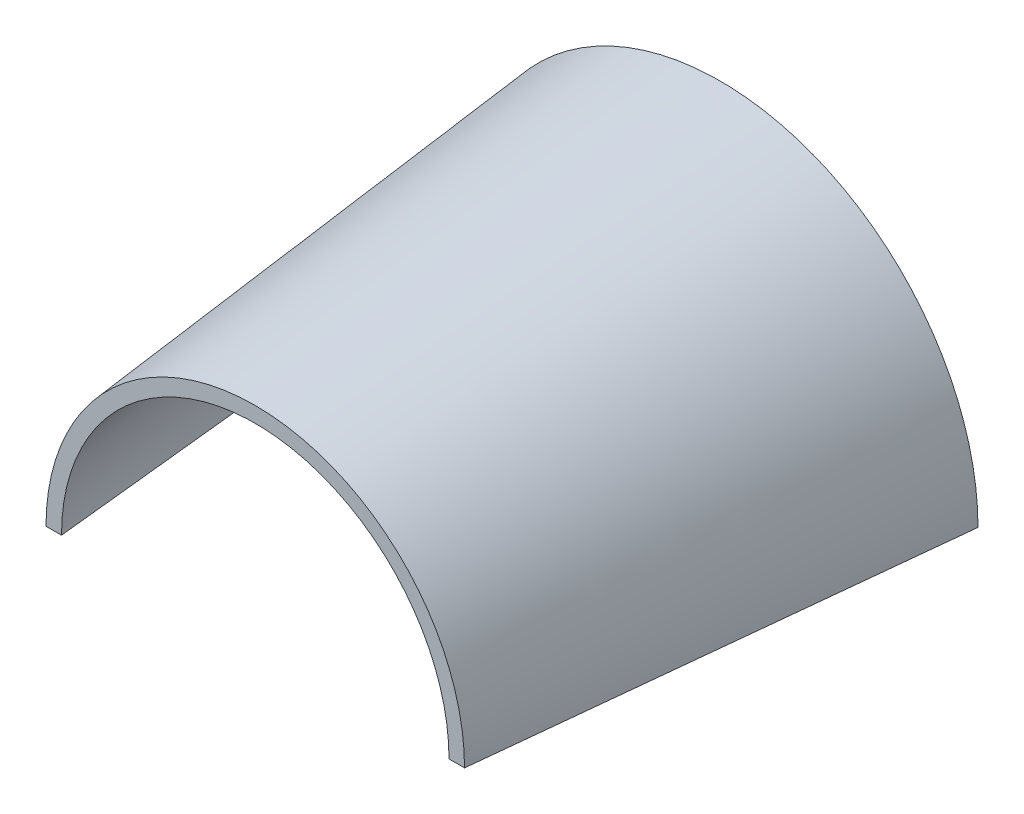
ISO-10303-21;
HEADER;
FILE_DESCRIPTION(('STEP AP214'),'2;1');
FILE_NAME('part.step','',(''),(''),'','','');
FILE_SCHEMA(('AUTOMOTIVE_DESIGN { 1 0 10303 214 1 1 1 1 }'));
ENDSEC;
DATA;
#1=APPLICATION_CONTEXT('core data for automotive mechanical design processes');
#2=APPLICATION_PROTOCOL_DEFINITION('international standard','automotive_design',2000,#1);
#3=PRODUCT_CONTEXT('',#1,'mechanical');
#4=PRODUCT('Part','Part','',(#3));
#5=PRODUCT_RELATED_PRODUCT_CATEGORY('part','',(#4));
#6=PRODUCT_DEFINITION_FORMATION('','',#4);
#7=PRODUCT_DEFINITION_CONTEXT('part definition',#1,'design');
#8=PRODUCT_DEFINITION('design','',#6,#7);
#9=PRODUCT_DEFINITION_SHAPE('','',#8);
#10=(LENGTH_UNIT() NAMED_UNIT(*) SI_UNIT(.MILLI.,.METRE.));
#11=(NAMED_UNIT(*) PLANE_ANGLE_UNIT() SI_UNIT($,.RADIAN.));
#12=(NAMED_UNIT(*) SI_UNIT($,.STERADIAN.) SOLID_ANGLE_UNIT());
#13=UNCERTAINTY_MEASURE_WITH_UNIT(LENGTH_MEASURE(1.E-05),#10,'distance_accuracy_value','');
#14=(GEOMETRIC_REPRESENTATION_CONTEXT(3) GLOBAL_UNCERTAINTY_ASSIGNED_CONTEXT((#13)) GLOBAL_UNIT_ASSIGNED_CONTEXT((#10,
#11,#12)) REPRESENTATION_CONTEXT('',''));
#15=CARTESIAN_POINT('',(0.,0.,0.));
#16=DIRECTION('',(0.,0.,1.));
#17=DIRECTION('',(1.,0.,0.));
#18=AXIS2_PLACEMENT_3D('',#15,#16,#17);
#19=CARTESIAN_POINT('',(0.,0.,120.));
#20=DIRECTION('',(0.,0.,1.));
#21=DIRECTION('',(1.,0.,0.));
#22=AXIS2_PLACEMENT_3D('',#19,#20,#21);
#23=PLANE('',#22);
#24=DIRECTION('',(1.,0.,0.));
#25=VECTOR('',#24,1.);
#26=CARTESIAN_POINT('',(0.,0.,120.));
#27=LINE('',#26,#25);
#28=CARTESIAN_POINT('',(50.,0.,120.));
#29=VERTEX_POINT('',#28);
#30=CARTESIAN_POINT('',(54.,0.,120.));
#31=VERTEX_POINT('',#30);
#32=EDGE_CURVE('E174',#29,#31,#27,.T.);
#33=ORIENTED_EDGE('',*,*,#32,.T.);
#34=CARTESIAN_POINT('',(0.,0.,120.));
#35=DIRECTION('',(0.,0.,1.));
#36=DIRECTION('',(1.,0.,0.));
#37=AXIS2_PLACEMENT_3D('',#34,#35,#36);
#38=CIRCLE('',#37,54.);
#39=CARTESIAN_POINT('',(-54.,0.,120.));
#40=VERTEX_POINT('',#39);
#41=EDGE_CURVE('E170',#31,#40,#38,.T.);
#42=ORIENTED_EDGE('',*,*,#41,.T.);
#43=DIRECTION('',(1.,0.,0.));
#44=VECTOR('',#43,1.);
#45=CARTESIAN_POINT('',(0.,0.,120.));
#46=LINE('',#45,#44);
#47=CARTESIAN_POINT('',(-50.,0.,120.));
#48=VERTEX_POINT('',#47);
#49=EDGE_CURVE('E106',#40,#48,#46,.T.);
#50=ORIENTED_EDGE('',*,*,#49,.T.);
#51=CARTESIAN_POINT('',(0.,0.,120.));
#52=DIRECTION('',(0.,0.,1.));
#53=DIRECTION('',(1.,0.,0.));
#54=AXIS2_PLACEMENT_3D('',#51,#52,#53);
#55=CIRCLE('',#54,50.);
#56=EDGE_CURVE('E13',#29,#48,#55,.T.);
#57=ORIENTED_EDGE('',*,*,#56,.F.);
#58=EDGE_LOOP('',(#33,#42,#50,#57));
#59=FACE_BOUND('',#58,.T.);
#60=ADVANCED_FACE('F95',(#59),#23,.T.);
#61=CARTESIAN_POINT('',(0.,0.,0.));
#62=DIRECTION('',(0.,0.,1.));
#63=DIRECTION('',(1.,0.,0.));
#64=AXIS2_PLACEMENT_3D('',#61,#62,#63);
#65=PLANE('',#64);
#66=DIRECTION('',(1.,0.,0.));
#67=VECTOR('',#66,1.);
#68=CARTESIAN_POINT('',(0.,0.,0.));
#69=LINE('',#68,#67);
#70=CARTESIAN_POINT('',(62.5,0.,0.));
#71=VERTEX_POINT('',#70);
#72=CARTESIAN_POINT('',(66.5,0.,0.));
#73=VERTEX_POINT('',#72);
#74=EDGE_CURVE('E145',#71,#73,#69,.T.);
#75=ORIENTED_EDGE('',*,*,#74,.F.);
#76=CARTESIAN_POINT('',(0.,0.,0.));
#77=DIRECTION('',(0.,0.,1.));
#78=DIRECTION('',(1.,0.,0.));
#79=AXIS2_PLACEMENT_3D('',#76,#77,#78);
#80=CIRCLE('',#79,62.5);
#81=CARTESIAN_POINT('',(-62.5,0.,0.));
#82=VERTEX_POINT('',#81);
#83=EDGE_CURVE('E229',#71,#82,#80,.T.);
#84=ORIENTED_EDGE('',*,*,#83,.T.);
#85=DIRECTION('',(-1.,0.,0.));
#86=VECTOR('',#85,1.);
#87=CARTESIAN_POINT('',(0.,0.,0.));
#88=LINE('',#87,#86);
#89=CARTESIAN_POINT('',(-66.5,0.,0.));
#90=VERTEX_POINT('',#89);
#91=EDGE_CURVE('E147',#82,#90,#88,.T.);
#92=ORIENTED_EDGE('',*,*,#91,.T.);
#93=CARTESIAN_POINT('',(0.,0.,0.));
#94=DIRECTION('',(0.,0.,1.));
#95=DIRECTION('',(1.,0.,0.));
#96=AXIS2_PLACEMENT_3D('',#93,#94,#95);
#97=CIRCLE('',#96,66.5);
#98=EDGE_CURVE('E141',#73,#90,#97,.T.);
#99=ORIENTED_EDGE('',*,*,#98,.F.);
#100=EDGE_LOOP('',(#75,#84,#92,#99));
#101=FACE_BOUND('',#100,.T.);
#102=ADVANCED_FACE('F144',(#101),#65,.F.);
#103=CARTESIAN_POINT('',(66.5,0.,0.));
#104=CARTESIAN_POINT('',(62.3333333333333,0.,40.));
#105=CARTESIAN_POINT('',(58.1666666666667,0.,80.));
#106=CARTESIAN_POINT('',(54.,0.,120.));
#107=CARTESIAN_POINT('',(66.5,4.35241478742894,0.));
#108=CARTESIAN_POINT('',(62.3333333333333,4.07970709398101,40.));
#109=CARTESIAN_POINT('',(58.1666666666667,3.80699940053308,80.));
#110=CARTESIAN_POINT('',(54.,3.53429170708515,120.));
#111=CARTESIAN_POINT('',(65.6428999755586,13.0571764997225,0.));
#112=CARTESIAN_POINT('',(61.5299382362228,12.2390504305927,39.9999999999999));
#113=CARTESIAN_POINT('',(57.416976496887,11.4209243614629,79.9999999999997));
#114=CARTESIAN_POINT('',(53.3040147575512,10.6027982923331,120.));
#115=CARTESIAN_POINT('',(61.8341063541393,25.6125517905188,0.));
#116=CARTESIAN_POINT('',(57.9597803577342,24.0077628618881,40.0000000000001));
#117=CARTESIAN_POINT('',(54.0854543613292,22.4029739332574,80.0000000000003));
#118=CARTESIAN_POINT('',(50.2111283649241,20.7981850046267,120.));
#119=CARTESIAN_POINT('',(55.6493033731848,37.1836475654939,0.));
#120=CARTESIAN_POINT('',(52.1625058175017,34.8538486187443,39.9999999999999));
#121=CARTESIAN_POINT('',(48.6757082618187,32.5240496719946,79.9999999999998));
#122=CARTESIAN_POINT('',(45.1889107061356,30.194250725245,120.));
#123=CARTESIAN_POINT('',(47.3258098495198,47.3258086871024,0.));
#124=CARTESIAN_POINT('',(44.3605285945918,44.3605354616453,40.0000000000001));
#125=CARTESIAN_POINT('',(41.3952473396639,41.3952622361883,80.0000000000002));
#126=CARTESIAN_POINT('',(38.4299660847359,38.4299890107312,120.));
#127=CARTESIAN_POINT('',(37.1836742405193,55.6492650380103,0.));
#128=CARTESIAN_POINT('',(34.8538687124275,52.1624704597443,39.9999999999999));
#129=CARTESIAN_POINT('',(32.5240631843357,48.6756758814783,79.9999999999999));
#130=CARTESIAN_POINT('',(30.1942576562438,45.1888813032123,120.));
#131=CARTESIAN_POINT('',(25.6125531444804,61.8341553424915,0.));
#132=CARTESIAN_POINT('',(24.0077541334971,57.959835604822,40.));
#133=CARTESIAN_POINT('',(22.4029551225138,54.0855158671526,80.0000000000001));
#134=CARTESIAN_POINT('',(20.7981561115305,50.2111961294832,120.));
#135=CARTESIAN_POINT('',(13.0571710714316,65.6427919652264,0.));
#136=CARTESIAN_POINT('',(12.2390518423359,61.5298351593443,40.));
#137=CARTESIAN_POINT('',(11.4209326132402,57.4168783534622,80.));
#138=CARTESIAN_POINT('',(10.6028133841444,53.30392154758,120.));
#139=CARTESIAN_POINT('',(0.,66.9288119051122,0.));
#140=CARTESIAN_POINT('',(0.,62.735277297787,39.9999999999999));
#141=CARTESIAN_POINT('',(0.,58.5417426904618,79.9999999999998));
#142=CARTESIAN_POINT('',(0.,54.3482080831366,120.));
#143=CARTESIAN_POINT('',(-13.0571710714316,65.6427919652264,0.));
#144=CARTESIAN_POINT('',(-12.2390518423359,61.5298351593443,40.0000000000001));
#145=CARTESIAN_POINT('',(-11.4209326132402,57.4168783534622,80.0000000000001));
#146=CARTESIAN_POINT('',(-10.6028133841445,53.3039215475801,120.));
#147=CARTESIAN_POINT('',(-25.6125531444805,61.8341553424915,0.));
#148=CARTESIAN_POINT('',(-24.0077541334972,57.959835604822,40.));
#149=CARTESIAN_POINT('',(-22.4029551225139,54.0855158671525,79.9999999999999));
#150=CARTESIAN_POINT('',(-20.7981561115307,50.211196129483,120.));
#151=CARTESIAN_POINT('',(-37.1836742405193,55.6492650380102,0.));
#152=CARTESIAN_POINT('',(-34.8538687124274,52.1624704597443,40.0000000000001));
#153=CARTESIAN_POINT('',(-32.5240631843356,48.6756758814783,80.0000000000002));
#154=CARTESIAN_POINT('',(-30.1942576562438,45.1888813032123,120.));
#155=CARTESIAN_POINT('',(-47.32580984952,47.3258086871023,0.));
#156=CARTESIAN_POINT('',(-44.360528594592,44.3605354616453,39.9999999999999));
#157=CARTESIAN_POINT('',(-41.395247339664,41.3952622361882,79.9999999999998));
#158=CARTESIAN_POINT('',(-38.4299660847361,38.4299890107311,120.));
#159=CARTESIAN_POINT('',(-55.6493033731847,37.183647565494,0.));
#160=CARTESIAN_POINT('',(-52.1625058175017,34.8538486187443,40.));
#161=CARTESIAN_POINT('',(-48.6757082618186,32.5240496719946,80.));
#162=CARTESIAN_POINT('',(-45.1889107061356,30.1942507252449,120.));
#163=CARTESIAN_POINT('',(-61.8341063541395,25.6125517905187,0.));
#164=CARTESIAN_POINT('',(-57.9597803577344,24.007762861888,40.0000000000001));
#165=CARTESIAN_POINT('',(-54.0854543613293,22.4029739332573,80.0000000000002));
#166=CARTESIAN_POINT('',(-50.2111283649242,20.7981850046266,120.));
#167=CARTESIAN_POINT('',(-65.6428999755585,13.0571764997225,0.));
#168=CARTESIAN_POINT('',(-61.5299382362228,12.2390504305927,39.9999999999999));
#169=CARTESIAN_POINT('',(-57.416976496887,11.4209243614629,79.9999999999998));
#170=CARTESIAN_POINT('',(-53.3040147575512,10.6027982923331,120.));
#171=CARTESIAN_POINT('',(-66.5,4.35241478742895,0.));
#172=CARTESIAN_POINT('',(-62.3333333333333,4.07970709398102,40.));
#173=CARTESIAN_POINT('',(-58.1666666666667,3.80699940053309,80.));
#174=CARTESIAN_POINT('',(-54.,3.53429170708516,120.));
#175=CARTESIAN_POINT('',(-66.5,0.,0.));
#176=CARTESIAN_POINT('',(-62.3333333333333,0.,40.));
#177=CARTESIAN_POINT('',(-58.1666666666667,0.,80.));
#178=CARTESIAN_POINT('',(-54.,0.,120.));
#179=B_SPLINE_SURFACE_WITH_KNOTS('',3,3,((#103,#104,#105,#106),(#107,#108,#109,#110),(#111,#112,
#113,#114),(#115,#116,#117,#118),(#119,#120,#121,#122),(#123,#124,#125,#126),(#127,#128,#129,
#130),(#131,#132,#133,#134),(#135,#136,#137,#138),(#139,#140,#141,#142),(#143,#144,#145,#146),
(#147,#148,#149,#150),(#151,#152,#153,#154),(#155,#156,#157,#158),(#159,#160,#161,#162),(#163,
#164,#165,#166),(#167,#168,#169,#170),(#171,#172,#173,#174),(#175,#176,#177,#178)),
.UNSPECIFIED.,.F.,.F.,.F.,(4,1,1,1,1,1,1,1,1,1,1,1,1,1,1,1,4),(4,4),(0.493827096149578,
0.52546290264023,0.557098709130881,0.588734515621532,0.620370322112184,0.652006128602835,
0.683641935093486,0.715277741584138,0.746913548074789,0.77854935456544,0.810185161056092,
0.841820967546743,0.873456774037395,0.905092580528046,0.936728387018697,0.968364193509349,1.),
(0.,1.),.UNSPECIFIED.);
#180=CARTESIAN_POINT('',(-66.5,0.,0.));
#181=CARTESIAN_POINT('',(-62.3333333333333,0.,40.));
#182=CARTESIAN_POINT('',(-58.1666666666667,0.,80.));
#183=CARTESIAN_POINT('',(-54.,0.,120.));
#184=B_SPLINE_CURVE_WITH_KNOTS('',3,(#180,#181,#182,#183),.UNSPECIFIED.,.F.,.F.,(4,4),(0.,1.),.UNSPECIFIED.);
#185=EDGE_CURVE('E172',#90,#40,#184,.T.);
#186=CARTESIAN_POINT('',(66.5,0.,0.));
#187=CARTESIAN_POINT('',(62.3333333333333,0.,40.));
#188=CARTESIAN_POINT('',(58.1666666666667,0.,80.));
#189=CARTESIAN_POINT('',(54.,0.,120.));
#190=B_SPLINE_CURVE_WITH_KNOTS('',3,(#186,#187,#188,#189),.UNSPECIFIED.,.F.,.F.,(4,4),(0.,1.),.UNSPECIFIED.);
#191=EDGE_CURVE('E161',#73,#31,#190,.T.);
#192=ORIENTED_EDGE('',*,*,#98,.T.);
#193=ORIENTED_EDGE('',*,*,#185,.T.);
#194=ORIENTED_EDGE('',*,*,#41,.F.);
#195=ORIENTED_EDGE('',*,*,#191,.F.);
#196=EDGE_LOOP('',(#192,#193,#194,#195));
#197=FACE_BOUND('',#196,.T.);
#198=ADVANCED_FACE('F168',(#197),#179,.T.);
#199=CARTESIAN_POINT('',(62.5,0.,0.));
#200=DIRECTION('',(0.,-1.,0.));
#201=DIRECTION('',(1.,0.,0.));
#202=AXIS2_PLACEMENT_3D('',#199,#200,#201);
#203=PLANE('',#202);
#204=ORIENTED_EDGE('',*,*,#74,.T.);
#205=ORIENTED_EDGE('',*,*,#191,.T.);
#206=ORIENTED_EDGE('',*,*,#32,.F.);
#207=CARTESIAN_POINT('',(62.5,0.,0.));
#208=CARTESIAN_POINT('',(58.3333333333333,0.,40.));
#209=CARTESIAN_POINT('',(54.1666666666667,0.,80.));
#210=CARTESIAN_POINT('',(50.,0.,120.));
#211=B_SPLINE_CURVE_WITH_KNOTS('',3,(#207,#208,#209,#210),.UNSPECIFIED.,.F.,.F.,(4,4),(0.,1.),.UNSPECIFIED.);
#212=EDGE_CURVE('E163',#71,#29,#211,.T.);
#213=ORIENTED_EDGE('',*,*,#212,.F.);
#214=EDGE_LOOP('',(#204,#205,#206,#213));
#215=FACE_BOUND('',#214,.T.);
#216=ADVANCED_FACE('F160',(#215),#203,.T.);
#217=CARTESIAN_POINT('',(-62.5,0.,0.));
#218=CARTESIAN_POINT('',(-58.3333333333333,0.,40.));
#219=CARTESIAN_POINT('',(-54.1666666666667,0.,80.));
#220=CARTESIAN_POINT('',(-50.,0.,120.));
#221=CARTESIAN_POINT('',(-62.5,4.09061540171894,0.));
#222=CARTESIAN_POINT('',(-58.3333333333333,3.81790770827101,40.));
#223=CARTESIAN_POINT('',(-54.1666666666667,3.54520001482308,80.));
#224=CARTESIAN_POINT('',(-50.,3.27249232137515,120.));
#225=CARTESIAN_POINT('',(-61.6944789009061,12.2717808336399,0.));
#226=CARTESIAN_POINT('',(-57.5815063287006,11.4536524927236,40.));
#227=CARTESIAN_POINT('',(-53.468533756495,10.6355241518074,79.9999999999999));
#228=CARTESIAN_POINT('',(-49.3555611842895,9.81739581089123,120.));
#229=CARTESIAN_POINT('',(-58.1147507749403,24.0719551708577,0.));
#230=CARTESIAN_POINT('',(-54.2404377979293,22.4671693186923,40.));
#231=CARTESIAN_POINT('',(-50.3661248209182,20.8623834665268,80.));
#232=CARTESIAN_POINT('',(-46.4918118439071,19.2575976143614,120.));
#233=CARTESIAN_POINT('',(-52.3019785391537,34.9470391854787,0.));
#234=CARTESIAN_POINT('',(-48.8151745734748,32.6172392242592,40.));
#235=CARTESIAN_POINT('',(-45.328370607796,30.2874392630397,79.9999999999999));
#236=CARTESIAN_POINT('',(-41.8415666421171,27.9576393018203,120.));
#237=CARTESIAN_POINT('',(-44.4791398513311,44.479146831703,0.));
#238=CARTESIAN_POINT('',(-41.5138618331051,41.5138743070192,40.0000000000001));
#239=CARTESIAN_POINT('',(-38.5485838148791,38.5486017823354,80.0000000000001));
#240=CARTESIAN_POINT('',(-35.5833057966532,35.5833292576516,120.));
#241=CARTESIAN_POINT('',(-34.9470612286555,52.3019417455162,0.));
#242=CARTESIAN_POINT('',(-32.6172538051846,48.8151469031721,40.));
#243=CARTESIAN_POINT('',(-30.2874463817138,45.328352060828,79.9999999999999));
#244=CARTESIAN_POINT('',(-27.9576389582429,41.8415572184839,120.));
#245=CARTESIAN_POINT('',(-24.0719461871635,58.1148085571114,0.));
#246=CARTESIAN_POINT('',(-22.4671480274373,54.2404890334635,40.));
#247=CARTESIAN_POINT('',(-20.8623498677112,50.3661695098155,80.));
#248=CARTESIAN_POINT('',(-19.257551707985,46.4918499861676,120.));
#249=CARTESIAN_POINT('',(-12.2717767086557,61.6943532819838,0.));
#250=CARTESIAN_POINT('',(-11.4536570529386,57.5813963609131,40.));
#251=CARTESIAN_POINT('',(-10.6355373972214,53.4684394398424,79.9999999999999));
#252=CARTESIAN_POINT('',(-9.8174177415043,49.3554825187718,120.));
#253=CARTESIAN_POINT('',(0.,62.9030188035953,0.));
#254=CARTESIAN_POINT('',(0.,58.709484294052,40.0000000000001));
#255=CARTESIAN_POINT('',(0.,54.5159497845087,80.0000000000001));
#256=CARTESIAN_POINT('',(0.,50.3224152749654,120.));
#257=CARTESIAN_POINT('',(12.271776708656,61.6943532819838,0.));
#258=CARTESIAN_POINT('',(11.4536570529387,57.5813963609132,39.9999999999999));
#259=CARTESIAN_POINT('',(10.6355373972215,53.4684394398425,79.9999999999997));
#260=CARTESIAN_POINT('',(9.8174177415043,49.3554825187718,120.));
#261=CARTESIAN_POINT('',(24.0719461871635,58.1148085571112,0.));
#262=CARTESIAN_POINT('',(22.4671480274373,54.2404890334633,40.0000000000002));
#263=CARTESIAN_POINT('',(20.8623498677111,50.3661695098155,80.0000000000004));
#264=CARTESIAN_POINT('',(19.2575517079849,46.4918499861676,120.000000000001));
#265=CARTESIAN_POINT('',(34.9470612286556,52.3019417455164,0.));
#266=CARTESIAN_POINT('',(32.6172538051847,48.8151469031722,39.9999999999998));
#267=CARTESIAN_POINT('',(30.2874463817138,45.3283520608281,79.9999999999996));
#268=CARTESIAN_POINT('',(27.9576389582429,41.841557218484,119.999999999999));
#269=CARTESIAN_POINT('',(44.4791398513311,44.4791468317029,0.));
#270=CARTESIAN_POINT('',(41.5138618331051,41.5138743070191,40.0000000000001));
#271=CARTESIAN_POINT('',(38.5485838148791,38.5486017823354,80.0000000000002));
#272=CARTESIAN_POINT('',(35.5833057966531,35.5833292576516,120.));
#273=CARTESIAN_POINT('',(52.3019785391538,34.9470391854786,0.));
#274=CARTESIAN_POINT('',(48.8151745734749,32.6172392242592,40.));
#275=CARTESIAN_POINT('',(45.3283706077961,30.2874392630398,80.));
#276=CARTESIAN_POINT('',(41.8415666421172,27.9576393018203,120.));
#277=CARTESIAN_POINT('',(58.1147507749402,24.0719551708578,0.));
#278=CARTESIAN_POINT('',(54.2404377979291,22.4671693186923,39.9999999999999));
#279=CARTESIAN_POINT('',(50.366124820918,20.8623834665268,79.9999999999999));
#280=CARTESIAN_POINT('',(46.491811843907,19.2575976143613,120.));
#281=CARTESIAN_POINT('',(61.6944789009063,12.2717808336397,0.));
#282=CARTESIAN_POINT('',(57.5815063287007,11.4536524927235,40.));
#283=CARTESIAN_POINT('',(53.4685337564951,10.6355241518074,80.));
#284=CARTESIAN_POINT('',(49.3555611842896,9.8173958108912,120.));
#285=CARTESIAN_POINT('',(62.5,4.09061540171893,0.));
#286=CARTESIAN_POINT('',(58.3333333333333,3.817907708271,40.));
#287=CARTESIAN_POINT('',(54.1666666666667,3.54520001482308,80.));
#288=CARTESIAN_POINT('',(50.,3.27249232137515,120.));
#289=CARTESIAN_POINT('',(62.5,0.,0.));
#290=CARTESIAN_POINT('',(58.3333333333333,0.,40.));
#291=CARTESIAN_POINT('',(54.1666666666667,0.,80.));
#292=CARTESIAN_POINT('',(50.,0.,120.));
#293=B_SPLINE_SURFACE_WITH_KNOTS('',3,3,((#217,#218,#219,#220),(#221,#222,#223,#224),(#225,#226,
#227,#228),(#229,#230,#231,#232),(#233,#234,#235,#236),(#237,#238,#239,#240),(#241,#242,#243,
#244),(#245,#246,#247,#248),(#249,#250,#251,#252),(#253,#254,#255,#256),(#257,#258,#259,#260),
(#261,#262,#263,#264),(#265,#266,#267,#268),(#269,#270,#271,#272),(#273,#274,#275,#276),(#277,
#278,#279,#280),(#281,#282,#283,#284),(#285,#286,#287,#288),(#289,#290,#291,#292)),
.UNSPECIFIED.,.F.,.F.,.F.,(4,1,1,1,1,1,1,1,1,1,1,1,1,1,1,1,4),(4,4),(0.0108145472573091,
0.0403269223594941,0.0698392974616791,0.0993516725638641,0.128864047666049,0.158376422768234,
0.187888797870419,0.217401172972604,0.246913548074789,0.276425923176974,0.305938298279159,
0.335450673381344,0.364963048483529,0.394475423585714,0.423987798687899,0.453500173790084,
0.483012548892269),(0.,1.),.UNSPECIFIED.);
#294=CARTESIAN_POINT('',(-62.5,0.,0.));
#295=CARTESIAN_POINT('',(-58.3333333333333,0.,40.));
#296=CARTESIAN_POINT('',(-54.1666666666667,0.,80.));
#297=CARTESIAN_POINT('',(-50.,0.,120.));
#298=B_SPLINE_CURVE_WITH_KNOTS('',3,(#294,#295,#296,#297),.UNSPECIFIED.,.F.,.F.,(4,4),(0.,1.),.UNSPECIFIED.);
#299=EDGE_CURVE('E121',#82,#48,#298,.T.);
#300=ORIENTED_EDGE('',*,*,#83,.F.);
#301=ORIENTED_EDGE('',*,*,#212,.T.);
#302=ORIENTED_EDGE('',*,*,#56,.T.);
#303=ORIENTED_EDGE('',*,*,#299,.F.);
#304=EDGE_LOOP('',(#300,#301,#302,#303));
#305=FACE_BOUND('',#304,.T.);
#306=ADVANCED_FACE('F204',(#305),#293,.T.);
#307=CARTESIAN_POINT('',(-66.5,0.,0.));
#308=DIRECTION('',(0.,-1.,0.));
#309=DIRECTION('',(1.,0.,0.));
#310=AXIS2_PLACEMENT_3D('',#307,#308,#309);
#311=PLANE('',#310);
#312=ORIENTED_EDGE('',*,*,#91,.F.);
#313=ORIENTED_EDGE('',*,*,#299,.T.);
#314=ORIENTED_EDGE('',*,*,#49,.F.);
#315=ORIENTED_EDGE('',*,*,#185,.F.);
#316=EDGE_LOOP('',(#312,#313,#314,#315));
#317=FACE_BOUND('',#316,.T.);
#318=ADVANCED_FACE('F97',(#317),#311,.T.);
#319=CLOSED_SHELL('',(#60,#102,#198,#216,#306,#318));
#320=MANIFOLD_SOLID_BREP('B2',#319);
#321=ADVANCED_BREP_SHAPE_REPRESENTATION('',(#18,#320),#14);
#322=SHAPE_DEFINITION_REPRESENTATION(#9,#321);
ENDSEC;
END-ISO-10303-21;
